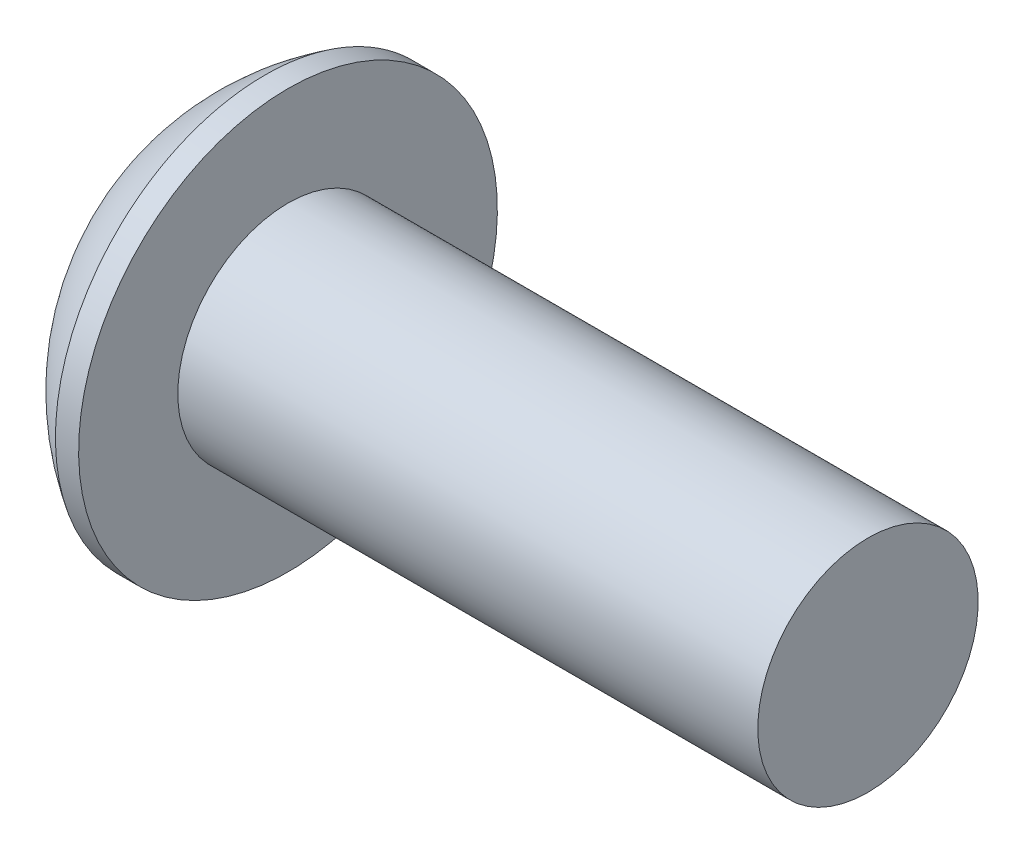
ISO-10303-21;
HEADER;
FILE_DESCRIPTION(('STEP AP214'),'2;1');
FILE_NAME('part.step','',(''),(''),'','','');
FILE_SCHEMA(('AUTOMOTIVE_DESIGN { 1 0 10303 214 1 1 1 1 }'));
ENDSEC;
DATA;
#1=APPLICATION_CONTEXT('core data for automotive mechanical design processes');
#2=APPLICATION_PROTOCOL_DEFINITION('international standard','automotive_design',2000,#1);
#3=PRODUCT_CONTEXT('',#1,'mechanical');
#4=PRODUCT('Part','Part','',(#3));
#5=PRODUCT_RELATED_PRODUCT_CATEGORY('part','',(#4));
#6=PRODUCT_DEFINITION_FORMATION('','',#4);
#7=PRODUCT_DEFINITION_CONTEXT('part definition',#1,'design');
#8=PRODUCT_DEFINITION('design','',#6,#7);
#9=PRODUCT_DEFINITION_SHAPE('','',#8);
#10=(LENGTH_UNIT() NAMED_UNIT(*) SI_UNIT(.MILLI.,.METRE.));
#11=(NAMED_UNIT(*) PLANE_ANGLE_UNIT() SI_UNIT($,.RADIAN.));
#12=(NAMED_UNIT(*) SI_UNIT($,.STERADIAN.) SOLID_ANGLE_UNIT());
#13=UNCERTAINTY_MEASURE_WITH_UNIT(LENGTH_MEASURE(1.E-05),#10,'distance_accuracy_value','');
#14=(GEOMETRIC_REPRESENTATION_CONTEXT(3) GLOBAL_UNCERTAINTY_ASSIGNED_CONTEXT((#13)) GLOBAL_UNIT_ASSIGNED_CONTEXT((#10,
#11,#12)) REPRESENTATION_CONTEXT('',''));
#15=CARTESIAN_POINT('',(0.,0.,0.));
#16=DIRECTION('',(0.,0.,1.));
#17=DIRECTION('',(1.,0.,0.));
#18=AXIS2_PLACEMENT_3D('',#15,#16,#17);
#19=CARTESIAN_POINT('',(-0.533400000000002,0.,0.));
#20=DIRECTION('',(-1.,0.,0.));
#21=DIRECTION('',(0.,0.,1.));
#22=AXIS2_PLACEMENT_3D('',#19,#20,#21);
#23=PLANE('',#22);
#24=DIRECTION('',(0.,0.5,0.866025403784439));
#25=VECTOR('',#24,1.);
#26=CARTESIAN_POINT('',(-0.533400000000002,1.83308710467706,0.));
#27=LINE('',#26,#25);
#28=CARTESIAN_POINT('',(-0.533400000000002,1.83308710467706,0.));
#29=VERTEX_POINT('',#28);
#30=CARTESIAN_POINT('',(-0.533400000000002,0.916543552338531,-1.5875));
#31=VERTEX_POINT('',#30);
#32=EDGE_CURVE('E116',#29,#31,#27,.F.);
#33=ORIENTED_EDGE('',*,*,#32,.T.);
#34=DIRECTION('',(0.,1.,0.));
#35=VECTOR('',#34,1.);
#36=CARTESIAN_POINT('',(-0.533400000000002,0.916543552338531,-1.5875));
#37=LINE('',#36,#35);
#38=CARTESIAN_POINT('',(-0.533400000000002,-0.916543552338531,-1.5875));
#39=VERTEX_POINT('',#38);
#40=EDGE_CURVE('E83',#31,#39,#37,.F.);
#41=ORIENTED_EDGE('',*,*,#40,.T.);
#42=DIRECTION('',(0.,0.5,-0.866025403784439));
#43=VECTOR('',#42,1.);
#44=CARTESIAN_POINT('',(-0.533400000000002,-0.916543552338531,-1.5875));
#45=LINE('',#44,#43);
#46=CARTESIAN_POINT('',(-0.533400000000002,-1.83308710467706,0.));
#47=VERTEX_POINT('',#46);
#48=EDGE_CURVE('E85',#39,#47,#45,.F.);
#49=ORIENTED_EDGE('',*,*,#48,.T.);
#50=DIRECTION('',(0.,-0.5,-0.866025403784439));
#51=VECTOR('',#50,1.);
#52=CARTESIAN_POINT('',(-0.533400000000002,-1.83308710467706,0.));
#53=LINE('',#52,#51);
#54=CARTESIAN_POINT('',(-0.533400000000002,-0.916543552338533,1.5875));
#55=VERTEX_POINT('',#54);
#56=EDGE_CURVE('E86',#47,#55,#53,.F.);
#57=ORIENTED_EDGE('',*,*,#56,.T.);
#58=DIRECTION('',(0.,-1.,0.));
#59=VECTOR('',#58,1.);
#60=CARTESIAN_POINT('',(-0.533400000000002,-0.916543552338532,1.5875));
#61=LINE('',#60,#59);
#62=CARTESIAN_POINT('',(-0.533400000000002,0.916543552338531,1.5875));
#63=VERTEX_POINT('',#62);
#64=EDGE_CURVE('E72',#55,#63,#61,.F.);
#65=ORIENTED_EDGE('',*,*,#64,.T.);
#66=DIRECTION('',(0.,-0.5,0.866025403784439));
#67=VECTOR('',#66,1.);
#68=CARTESIAN_POINT('',(-0.533400000000002,0.916543552338531,1.5875));
#69=LINE('',#68,#67);
#70=EDGE_CURVE('E111',#63,#29,#69,.F.);
#71=ORIENTED_EDGE('',*,*,#70,.T.);
#72=EDGE_LOOP('',(#33,#41,#49,#57,#65,#71));
#73=FACE_BOUND('',#72,.T.);
#74=ADVANCED_FACE('F18',(#73),#23,.T.);
#75=CARTESIAN_POINT('',(-0.533400000000002,-1.83308710467706,0.));
#76=DIRECTION('',(0.,-0.866025403784439,0.5));
#77=DIRECTION('',(0.,-0.5,-0.866025403784439));
#78=AXIS2_PLACEMENT_3D('',#75,#76,#77);
#79=PLANE('',#78);
#80=CARTESIAN_POINT('',(-2.56539999994394,-1.8330871046745,-2.00804498786736E-11));
#81=CARTESIAN_POINT('',(-2.53392818229741,-1.80158505518366,0.0545631502562923));
#82=CARTESIAN_POINT('',(-2.5043050627177,-1.76955629074211,0.110038597579172));
#83=CARTESIAN_POINT('',(-2.45006639539122,-1.70424635317817,0.223158727683824));
#84=CARTESIAN_POINT('',(-2.42548101615987,-1.6709589724711,0.280814162317604));
#85=CARTESIAN_POINT('',(-2.38336609605347,-1.60383660211837,0.397073518091736));
#86=CARTESIAN_POINT('',(-2.36573072948629,-1.57001869730198,0.455647847439699));
#87=CARTESIAN_POINT('',(-2.33856008862263,-1.50163859306838,0.574085662199493));
#88=CARTESIAN_POINT('',(-2.32900454007239,-1.46707848106388,0.633945532106421));
#89=CARTESIAN_POINT('',(-2.32038274183869,-1.40751253669323,0.737116774157155));
#90=CARTESIAN_POINT('',(-2.31910682172836,-1.38258360390154,0.780294952330845));
#91=CARTESIAN_POINT('',(-2.32125913780735,-1.33276652395073,0.866580665890379));
#92=CARTESIAN_POINT('',(-2.32468902284537,-1.30787839414808,0.90968817121394));
#93=CARTESIAN_POINT('',(-2.33605631415915,-1.25834345643267,0.995485200086784));
#94=CARTESIAN_POINT('',(-2.34399762019329,-1.23369687609494,1.03817432946455));
#95=CARTESIAN_POINT('',(-2.36395627681902,-1.18481740842653,1.12283605091316));
#96=CARTESIAN_POINT('',(-2.37597537628367,-1.16058470328902,1.16480832741616));
#97=CARTESIAN_POINT('',(-2.41164383187845,-1.09853862948576,1.27227527965358));
#98=CARTESIAN_POINT('',(-2.43797770752625,-1.06110942924036,1.33710455616529));
#99=CARTESIAN_POINT('',(-2.48243061452926,-1.00607390269188,1.43242888436855));
#100=CARTESIAN_POINT('',(-2.49804835924321,-0.987937988038022,1.46384120999077));
#101=CARTESIAN_POINT('',(-2.53070945051393,-0.951999508520197,1.52608848246242));
#102=CARTESIAN_POINT('',(-2.54775211871235,-0.934196789917587,1.55692369559499));
#103=CARTESIAN_POINT('',(-2.56539999993807,-0.916543552329633,1.58750000001541));
#104=B_SPLINE_CURVE_WITH_KNOTS('',3,(#80,#81,#82,#83,#84,#85,#86,#87,#88,#89,#90,#91,#92,#93,
#94,#95,#96,#97,#98,#99,#100,#101,#102,#103),.UNSPECIFIED.,.F.,.F.,(4,2,2,2,2,2,2,2,2,2,2,4),
(0.,0.211427927732169,0.424087197148228,0.633370156422424,0.842126401515785,0.991537201098734,
1.14100036552056,1.29059292577265,1.44024972414947,1.67781721417335,1.79627069411587,
1.91466809995991),.UNSPECIFIED.);
#105=CARTESIAN_POINT('',(-2.56539999993857,-1.83308710468646,0.));
#106=VERTEX_POINT('',#105);
#107=CARTESIAN_POINT('',(-2.56539999993106,-0.916543552342318,1.5875));
#108=VERTEX_POINT('',#107);
#109=EDGE_CURVE('E21',#106,#108,#104,.T.);
#110=ORIENTED_EDGE('',*,*,#109,.T.);
#111=DIRECTION('',(1.,0.,0.));
#112=VECTOR('',#111,1.);
#113=CARTESIAN_POINT('',(-0.533400000000002,-0.916543552338533,1.5875));
#114=LINE('',#113,#112);
#115=EDGE_CURVE('E91',#108,#55,#114,.T.);
#116=ORIENTED_EDGE('',*,*,#115,.T.);
#117=ORIENTED_EDGE('',*,*,#56,.F.);
#118=DIRECTION('',(1.,0.,0.));
#119=VECTOR('',#118,1.);
#120=CARTESIAN_POINT('',(-0.533400000000002,-1.83308710467706,0.));
#121=LINE('',#120,#119);
#122=EDGE_CURVE('E59',#47,#106,#121,.F.);
#123=ORIENTED_EDGE('',*,*,#122,.T.);
#124=EDGE_LOOP('',(#110,#116,#117,#123));
#125=FACE_BOUND('',#124,.T.);
#126=ADVANCED_FACE('F90',(#125),#79,.F.);
#127=CARTESIAN_POINT('',(-0.533400000000002,-0.916543552338531,-1.5875));
#128=DIRECTION('',(0.,-0.866025403784439,-0.5));
#129=DIRECTION('',(0.,0.5,-0.866025403784439));
#130=AXIS2_PLACEMENT_3D('',#127,#128,#129);
#131=PLANE('',#130);
#132=CARTESIAN_POINT('',(-2.56539999994527,-0.916543552319403,-1.58750000001409));
#133=CARTESIAN_POINT('',(-2.53392818229919,-0.948045601822691,-1.53293684974403));
#134=CARTESIAN_POINT('',(-2.50430506271949,-0.980074366269487,-1.47746140242354));
#135=CARTESIAN_POINT('',(-2.45006639539264,-1.04538430383757,-1.36434127232016));
#136=CARTESIAN_POINT('',(-2.42548101616093,-1.07867168454351,-1.30668583768523));
#137=CARTESIAN_POINT('',(-2.38336609605398,-1.14579405489574,-1.19042648190974));
#138=CARTESIAN_POINT('',(-2.36573072948662,-1.17961195971273,-1.13185215256154));
#139=CARTESIAN_POINT('',(-2.3385600886227,-1.2479920639471,-1.013414337801));
#140=CARTESIAN_POINT('',(-2.32900454007237,-1.28255217595175,-0.953554467893575));
#141=CARTESIAN_POINT('',(-2.32038274183866,-1.34211812032265,-0.850383225842316));
#142=CARTESIAN_POINT('',(-2.31910682172835,-1.36704705311438,-0.807205047668587));
#143=CARTESIAN_POINT('',(-2.32125913780739,-1.41686413306525,-0.720919334108961));
#144=CARTESIAN_POINT('',(-2.32468902284544,-1.44175226286793,-0.67781182878535));
#145=CARTESIAN_POINT('',(-2.33605631415929,-1.49128720058339,-0.592014799912417));
#146=CARTESIAN_POINT('',(-2.34399762019345,-1.51593378092113,-0.54932567053461));
#147=CARTESIAN_POINT('',(-2.36395627681926,-1.56481324858959,-0.464663949085931));
#148=CARTESIAN_POINT('',(-2.37597537628395,-1.58904595372712,-0.422691672582891));
#149=CARTESIAN_POINT('',(-2.41164383187876,-1.65109202753029,-0.315224720345625));
#150=CARTESIAN_POINT('',(-2.43797770752652,-1.6885212277756,-0.250395443834082));
#151=CARTESIAN_POINT('',(-2.48243061452944,-1.74355675432393,-0.15507111563107));
#152=CARTESIAN_POINT('',(-2.49804835924337,-1.76169266897775,-0.123658790008927));
#153=CARTESIAN_POINT('',(-2.53070945051401,-1.79763114849548,-0.0614115175374324));
#154=CARTESIAN_POINT('',(-2.5477521187124,-1.81543386709805,-0.0305763044049344));
#155=CARTESIAN_POINT('',(-2.56539999993807,-1.83308710468596,1.54136844652939E-11));
#156=B_SPLINE_CURVE_WITH_KNOTS('',3,(#132,#133,#134,#135,#136,#137,#138,#139,#140,#141,#142,
#143,#144,#145,#146,#147,#148,#149,#150,#151,#152,#153,#154,#155),.UNSPECIFIED.,.F.,.F.,(4,2,2,
2,2,2,2,2,2,2,2,4),(0.,0.211427927733669,0.424087197151313,0.633370156427101,0.842126401522016,
0.99153720110513,1.14100036552713,1.29059292577937,1.44024972415633,1.67781721417961,
1.79627069412184,1.9146680999656),.UNSPECIFIED.);
#157=CARTESIAN_POINT('',(-2.56539999995198,-0.916543552351339,-1.58750000002218));
#158=VERTEX_POINT('',#157);
#159=EDGE_CURVE('E95',#158,#106,#156,.T.);
#160=ORIENTED_EDGE('',*,*,#159,.T.);
#161=ORIENTED_EDGE('',*,*,#122,.F.);
#162=ORIENTED_EDGE('',*,*,#48,.F.);
#163=DIRECTION('',(-1.,0.,0.));
#164=VECTOR('',#163,1.);
#165=CARTESIAN_POINT('',(-0.533400000000002,-0.916543552338531,-1.5875));
#166=LINE('',#165,#164);
#167=EDGE_CURVE('E97',#39,#158,#166,.T.);
#168=ORIENTED_EDGE('',*,*,#167,.T.);
#169=EDGE_LOOP('',(#160,#161,#162,#168));
#170=FACE_BOUND('',#169,.T.);
#171=ADVANCED_FACE('F93',(#170),#131,.F.);
#172=CARTESIAN_POINT('',(-0.533400000000002,0.916543552338531,-1.5875));
#173=DIRECTION('',(0.,0.,-1.));
#174=DIRECTION('',(-1.,0.,0.));
#175=AXIS2_PLACEMENT_3D('',#172,#173,#174);
#176=PLANE('',#175);
#177=CARTESIAN_POINT('',(-2.56539999994527,0.916543552360294,-1.58749999999048));
#178=CARTESIAN_POINT('',(-2.53392818229821,0.853539453376781,-1.58749999999657));
#179=CARTESIAN_POINT('',(-2.50430506271702,0.789481924500113,-1.58749999999908));
#180=CARTESIAN_POINT('',(-2.45006639538581,0.658862049392287,-1.58750000000093));
#181=CARTESIAN_POINT('',(-2.42548101615122,0.59228728799181,-1.58750000000025));
#182=CARTESIAN_POINT('',(-2.38336609603683,0.458042547310979,-1.58749999999976));
#183=CARTESIAN_POINT('',(-2.36573072946494,0.390406737689213,-1.58749999999994));
#184=CARTESIAN_POINT('',(-2.3385600885904,0.253646529243895,-1.58750000000006));
#185=CARTESIAN_POINT('',(-2.32900454003397,0.184526305245804,-1.58750000000001));
#186=CARTESIAN_POINT('',(-2.32038274178942,0.0653944165301613,-1.58749999999999));
#187=CARTESIAN_POINT('',(-2.31910682167392,0.0155365509618711,-1.5875));
#188=CARTESIAN_POINT('',(-2.3212591377409,-0.0840976089101244,-1.5875));
#189=CARTESIAN_POINT('',(-2.32468902277208,-0.133873868500894,-1.5875));
#190=CARTESIAN_POINT('',(-2.33605631407098,-0.2329437439033,-1.5875));
#191=CARTESIAN_POINT('',(-2.34399762009707,-0.282236904564879,-1.5875));
#192=CARTESIAN_POINT('',(-2.36395627670599,-0.379995839874564,-1.5875));
#193=CARTESIAN_POINT('',(-2.37597537616188,-0.428461250136325,-1.5875));
#194=CARTESIAN_POINT('',(-2.41164383175616,-0.552553397787632,-1.5875));
#195=CARTESIAN_POINT('',(-2.43797770742117,-0.627411798334259,-1.5875));
#196=CARTESIAN_POINT('',(-2.48243061445881,-0.737482851511091,-1.5875));
#197=CARTESIAN_POINT('',(-2.49804835918582,-0.773754680844889,-1.5875));
#198=CARTESIAN_POINT('',(-2.53070945048496,-0.845631639931401,-1.5875));
#199=CARTESIAN_POINT('',(-2.54775211869874,-0.881237077161412,-1.5875));
#200=CARTESIAN_POINT('',(-2.56539999994071,-0.916543552361606,-1.5875));
#201=B_SPLINE_CURVE_WITH_KNOTS('',3,(#177,#178,#179,#180,#181,#182,#183,#184,#185,#186,#187,
#188,#189,#190,#191,#192,#193,#194,#195,#196,#197,#198,#199,#200),.UNSPECIFIED.,.F.,.F.,(4,2,2,
2,2,2,2,2,2,2,2,4),(0.,0.211427927701375,0.424087197086717,0.633370156331471,0.842126401395377,
0.991537200933545,1.14100036531054,1.29059292551773,1.44024972384963,1.677817214047,
1.79627069407681,1.91466810000777),.UNSPECIFIED.);
#202=CARTESIAN_POINT('',(-2.56539999995198,0.916543552337129,-1.58749999999757));
#203=VERTEX_POINT('',#202);
#204=EDGE_CURVE('E199',#203,#158,#201,.T.);
#205=ORIENTED_EDGE('',*,*,#204,.T.);
#206=ORIENTED_EDGE('',*,*,#167,.F.);
#207=ORIENTED_EDGE('',*,*,#40,.F.);
#208=DIRECTION('',(1.,0.,0.));
#209=VECTOR('',#208,1.);
#210=CARTESIAN_POINT('',(-0.533400000000002,0.916543552338531,-1.5875));
#211=LINE('',#210,#209);
#212=EDGE_CURVE('E113',#31,#203,#211,.F.);
#213=ORIENTED_EDGE('',*,*,#212,.T.);
#214=EDGE_LOOP('',(#205,#206,#207,#213));
#215=FACE_BOUND('',#214,.T.);
#216=ADVANCED_FACE('F189',(#215),#176,.F.);
#217=CARTESIAN_POINT('',(-0.533400000000002,1.83308710467706,0.));
#218=DIRECTION('',(0.,0.866025403784439,-0.5));
#219=DIRECTION('',(0.,0.5,0.866025403784439));
#220=AXIS2_PLACEMENT_3D('',#217,#218,#219);
#221=PLANE('',#220);
#222=CARTESIAN_POINT('',(-2.56539999994394,1.8330871046745,2.00800374309997E-11));
#223=CARTESIAN_POINT('',(-2.5339281822974,1.80158505518366,-0.0545631502562965));
#224=CARTESIAN_POINT('',(-2.5043050627177,1.76955629074211,-0.11003859757918));
#225=CARTESIAN_POINT('',(-2.45006639539121,1.70424635317816,-0.22315872768384));
#226=CARTESIAN_POINT('',(-2.42548101615987,1.67095897247109,-0.280814162317626));
#227=CARTESIAN_POINT('',(-2.38336609605347,1.60383660211835,-0.397073518091758));
#228=CARTESIAN_POINT('',(-2.36573072948628,1.57001869730197,-0.455647847439717));
#229=CARTESIAN_POINT('',(-2.33856008862263,1.50163859306837,-0.574085662199503));
#230=CARTESIAN_POINT('',(-2.32900454007239,1.46707848106388,-0.633945532106426));
#231=CARTESIAN_POINT('',(-2.32038274183869,1.40751253669322,-0.737116774157154));
#232=CARTESIAN_POINT('',(-2.31910682172836,1.38258360390154,-0.780294952330843));
#233=CARTESIAN_POINT('',(-2.32125913780735,1.33276652395073,-0.866580665890374));
#234=CARTESIAN_POINT('',(-2.32468902284537,1.30787839414808,-0.909688171213933));
#235=CARTESIAN_POINT('',(-2.33605631415915,1.25834345643267,-0.995485200086777));
#236=CARTESIAN_POINT('',(-2.34399762019328,1.23369687609495,-1.03817432946455));
#237=CARTESIAN_POINT('',(-2.36395627681902,1.18481740842653,-1.12283605091316));
#238=CARTESIAN_POINT('',(-2.37597537628367,1.16058470328902,-1.16480832741616));
#239=CARTESIAN_POINT('',(-2.41164383187872,1.09853862948529,-1.2722752796544));
#240=CARTESIAN_POINT('',(-2.43797770752691,1.06110942923942,-1.33710455616691));
#241=CARTESIAN_POINT('',(-2.48243061453059,1.00607390269029,-1.43242888437131));
#242=CARTESIAN_POINT('',(-2.49804835924479,0.987937988036214,-1.4638412099939));
#243=CARTESIAN_POINT('',(-2.53070945051602,0.951999508517968,-1.52608848246628));
#244=CARTESIAN_POINT('',(-2.54775211871471,0.934196789915152,-1.55692369559921));
#245=CARTESIAN_POINT('',(-2.56539999994071,0.916543552326994,-1.58750000001998));
#246=B_SPLINE_CURVE_WITH_KNOTS('',3,(#222,#223,#224,#225,#226,#227,#228,#229,#230,#231,#232,
#233,#234,#235,#236,#237,#238,#239,#240,#241,#242,#243,#244,#245),.UNSPECIFIED.,.F.,.F.,(4,2,2,
2,2,2,2,2,2,2,2,4),(0.,0.211427927732185,0.424087197148259,0.63337015642244,0.842126401515786,
0.99153720109873,1.14100036552055,1.29059292577265,1.44024972414947,1.67781721417631,
1.7962706941203,1.9146680999658),.UNSPECIFIED.);
#247=CARTESIAN_POINT('',(-2.56539999993857,1.83308710468646,0.));
#248=VERTEX_POINT('',#247);
#249=EDGE_CURVE('E193',#248,#203,#246,.T.);
#250=ORIENTED_EDGE('',*,*,#249,.T.);
#251=ORIENTED_EDGE('',*,*,#212,.F.);
#252=ORIENTED_EDGE('',*,*,#32,.F.);
#253=DIRECTION('',(1.,0.,0.));
#254=VECTOR('',#253,1.);
#255=CARTESIAN_POINT('',(-0.533400000000002,1.83308710467706,0.));
#256=LINE('',#255,#254);
#257=EDGE_CURVE('E108',#29,#248,#256,.F.);
#258=ORIENTED_EDGE('',*,*,#257,.T.);
#259=EDGE_LOOP('',(#250,#251,#252,#258));
#260=FACE_BOUND('',#259,.T.);
#261=ADVANCED_FACE('F185',(#260),#221,.F.);
#262=CARTESIAN_POINT('',(-0.533400000000002,0.916543552338531,1.5875));
#263=DIRECTION('',(0.,0.866025403784439,0.5));
#264=DIRECTION('',(0.,-0.5,0.866025403784439));
#265=AXIS2_PLACEMENT_3D('',#262,#263,#264);
#266=PLANE('',#265);
#267=CARTESIAN_POINT('',(-2.56539999994394,0.91654355231986,1.58750000000782));
#268=CARTESIAN_POINT('',(-2.53392818229741,0.948045601824288,1.5329368497393));
#269=CARTESIAN_POINT('',(-2.5043050627177,0.980074366271431,1.47746140241964));
#270=CARTESIAN_POINT('',(-2.45006639539122,1.04538430383949,1.36434127231737));
#271=CARTESIAN_POINT('',(-2.42548101615987,1.07867168454504,1.30668583768271));
#272=CARTESIAN_POINT('',(-2.38336609605347,1.14579405489669,1.19042648190795));
#273=CARTESIAN_POINT('',(-2.36573072948629,1.17961195971347,1.13185215256022));
#274=CARTESIAN_POINT('',(-2.33856008862263,1.24799206394736,1.01341433780059));
#275=CARTESIAN_POINT('',(-2.32900454007239,1.28255217595174,0.953554467893597));
#276=CARTESIAN_POINT('',(-2.32038274183869,1.34211812032234,0.850383225842832));
#277=CARTESIAN_POINT('',(-2.31910682172836,1.36704705311405,0.807205047669152));
#278=CARTESIAN_POINT('',(-2.32125913780735,1.41686413306487,0.720919334109624));
#279=CARTESIAN_POINT('',(-2.32468902284537,1.44175226286752,0.677811828786061));
#280=CARTESIAN_POINT('',(-2.33605631415915,1.49128720058292,0.592014799913215));
#281=CARTESIAN_POINT('',(-2.34399762019328,1.51593378092065,0.549325670535446));
#282=CARTESIAN_POINT('',(-2.36395627681902,1.56481324858906,0.464663949086841));
#283=CARTESIAN_POINT('',(-2.37597537628367,1.58904595372657,0.422691672583837));
#284=CARTESIAN_POINT('',(-2.41164383187845,1.65109202752983,0.315224720346425));
#285=CARTESIAN_POINT('',(-2.43797770752625,1.68852122777524,0.250395443834706));
#286=CARTESIAN_POINT('',(-2.48243061452926,1.74355675432371,0.155071115631445));
#287=CARTESIAN_POINT('',(-2.49804835924321,1.76169266897757,0.123658790009225));
#288=CARTESIAN_POINT('',(-2.53070945051393,1.7976311484954,0.0614115175375789));
#289=CARTESIAN_POINT('',(-2.54775211871235,1.81543386709801,0.0305763044050067));
#290=CARTESIAN_POINT('',(-2.56539999993807,1.83308710468596,-1.54142580803093E-11));
#291=B_SPLINE_CURVE_WITH_KNOTS('',3,(#267,#268,#269,#270,#271,#272,#273,#274,#275,#276,#277,
#278,#279,#280,#281,#282,#283,#284,#285,#286,#287,#288,#289,#290),.UNSPECIFIED.,.F.,.F.,(4,2,2,
2,2,2,2,2,2,2,2,4),(0.,0.211427927732169,0.424087197148227,0.633370156422423,0.842126401515785,
0.991537201098733,1.14100036552056,1.29059292577265,1.44024972414946,1.67781721417335,
1.79627069411587,1.91466809995991),.UNSPECIFIED.);
#292=CARTESIAN_POINT('',(-2.56539999993857,0.91654355234323,1.58750000000814));
#293=VERTEX_POINT('',#292);
#294=EDGE_CURVE('E167',#293,#248,#291,.T.);
#295=ORIENTED_EDGE('',*,*,#294,.T.);
#296=ORIENTED_EDGE('',*,*,#257,.F.);
#297=ORIENTED_EDGE('',*,*,#70,.F.);
#298=DIRECTION('',(1.,0.,0.));
#299=VECTOR('',#298,1.);
#300=CARTESIAN_POINT('',(-0.533400000000002,0.916543552338531,1.5875));
#301=LINE('',#300,#299);
#302=EDGE_CURVE('E40',#63,#293,#301,.F.);
#303=ORIENTED_EDGE('',*,*,#302,.T.);
#304=EDGE_LOOP('',(#295,#296,#297,#303));
#305=FACE_BOUND('',#304,.T.);
#306=ADVANCED_FACE('F178',(#305),#266,.F.);
#307=CARTESIAN_POINT('',(-0.533400000000002,-0.916543552338532,1.5875));
#308=DIRECTION('',(0.,0.,1.));
#309=DIRECTION('',(0.,-1.,0.));
#310=AXIS2_PLACEMENT_3D('',#307,#308,#309);
#311=PLANE('',#310);
#312=CARTESIAN_POINT('',(-2.56539999994394,-0.916543552354642,1.58749999998774));
#313=CARTESIAN_POINT('',(-2.53392818229741,-0.853539453359365,1.58749999999559));
#314=CARTESIAN_POINT('',(-2.50430506271771,-0.789481924470656,1.58749999999882));
#315=CARTESIAN_POINT('',(-2.45006639539122,-0.658862049338629,1.58750000000119));
#316=CARTESIAN_POINT('',(-2.42548101615988,-0.592287287925995,1.58750000000032));
#317=CARTESIAN_POINT('',(-2.38336609605349,-0.458042547221593,1.58749999999969));
#318=CARTESIAN_POINT('',(-2.36573072948631,-0.390406737588416,1.58749999999992));
#319=CARTESIAN_POINT('',(-2.33856008862266,-0.253646529120892,1.58750000000008));
#320=CARTESIAN_POINT('',(-2.32900454007243,-0.184526305112002,1.58750000000002));
#321=CARTESIAN_POINT('',(-2.32038274183874,-0.065394416370719,1.58749999999999));
#322=CARTESIAN_POINT('',(-2.31910682172841,-0.0155365507873145,1.5875));
#323=CARTESIAN_POINT('',(-2.32125913780742,0.0840976091143436,1.5875));
#324=CARTESIAN_POINT('',(-2.32468902284545,0.133873868719661,1.5875));
#325=CARTESIAN_POINT('',(-2.33605631415924,0.232943744150505,1.5875));
#326=CARTESIAN_POINT('',(-2.34399762019338,0.282236904825971,1.5875));
#327=CARTESIAN_POINT('',(-2.36395627681913,0.379995840162817,1.5875));
#328=CARTESIAN_POINT('',(-2.37597537628379,0.428461250437852,1.5875));
#329=CARTESIAN_POINT('',(-2.41164383187857,0.552553398044325,1.5875));
#330=CARTESIAN_POINT('',(-2.43797770752636,0.627411798535089,1.5875));
#331=CARTESIAN_POINT('',(-2.48243061452933,0.737482851631955,1.5875));
#332=CARTESIAN_POINT('',(-2.49804835924327,0.773754680939651,1.5875));
#333=CARTESIAN_POINT('',(-2.53070945051396,0.84563163997525,1.5875));
#334=CARTESIAN_POINT('',(-2.54775211871237,0.881237077180446,1.5875));
#335=CARTESIAN_POINT('',(-2.56539999993807,0.91654355235633,1.5875));
#336=B_SPLINE_CURVE_WITH_KNOTS('',3,(#312,#313,#314,#315,#316,#317,#318,#319,#320,#321,#322,
#323,#324,#325,#326,#327,#328,#329,#330,#331,#332,#333,#334,#335),.UNSPECIFIED.,.F.,.F.,(4,2,2,
2,2,2,2,2,2,2,2,4),(0.,0.211427927732202,0.424087197148294,0.633370156422521,0.842126401515914,
0.991537201098908,1.14100036552078,1.29059292577292,1.44024972414978,1.67781721417349,
1.79627069411592,1.91466809995988),.UNSPECIFIED.);
#337=EDGE_CURVE('E159',#108,#293,#336,.T.);
#338=ORIENTED_EDGE('',*,*,#337,.T.);
#339=ORIENTED_EDGE('',*,*,#302,.F.);
#340=ORIENTED_EDGE('',*,*,#64,.F.);
#341=ORIENTED_EDGE('',*,*,#115,.F.);
#342=EDGE_LOOP('',(#338,#339,#340,#341));
#343=FACE_BOUND('',#342,.T.);
#344=ADVANCED_FACE('F174',(#343),#311,.F.);
#345=CARTESIAN_POINT('',(-2.56540000003724,0.,0.));
#346=DIRECTION('',(-1.,0.,0.));
#347=DIRECTION('',(0.,-1.,0.));
#348=AXIS2_PLACEMENT_3D('',#345,#346,#347);
#349=CONICAL_SURFACE('',#348,1.83308710478514,0.78539816351237);
#350=ORIENTED_EDGE('',*,*,#109,.F.);
#351=CARTESIAN_POINT('',(-2.56539999992356,0.,0.));
#352=DIRECTION('',(-1.,0.,0.));
#353=DIRECTION('',(0.,-1.,0.));
#354=AXIS2_PLACEMENT_3D('',#351,#352,#353);
#355=CIRCLE('',#354,1.83308710467145);
#356=EDGE_CURVE('E166',#108,#106,#355,.F.);
#357=ORIENTED_EDGE('',*,*,#356,.F.);
#358=EDGE_LOOP('',(#350,#357));
#359=FACE_BOUND('',#358,.T.);
#360=ADVANCED_FACE('F177',(#359),#349,.F.);
#361=CARTESIAN_POINT('',(-2.56540000003724,0.,0.));
#362=DIRECTION('',(-1.,0.,0.));
#363=DIRECTION('',(0.,-1.,0.));
#364=AXIS2_PLACEMENT_3D('',#361,#362,#363);
#365=CONICAL_SURFACE('',#364,1.83308710478514,0.78539816351237);
#366=ORIENTED_EDGE('',*,*,#159,.F.);
#367=CARTESIAN_POINT('',(-2.56539999992356,0.,0.));
#368=DIRECTION('',(-1.,0.,0.));
#369=DIRECTION('',(0.,-1.,0.));
#370=AXIS2_PLACEMENT_3D('',#367,#368,#369);
#371=CIRCLE('',#370,1.83308710467145);
#372=EDGE_CURVE('E273',#106,#158,#371,.F.);
#373=ORIENTED_EDGE('',*,*,#372,.F.);
#374=EDGE_LOOP('',(#366,#373));
#375=FACE_BOUND('',#374,.T.);
#376=ADVANCED_FACE('F211',(#375),#365,.F.);
#377=CARTESIAN_POINT('',(-2.56540000003724,0.,0.));
#378=DIRECTION('',(-1.,0.,0.));
#379=DIRECTION('',(0.,-1.,0.));
#380=AXIS2_PLACEMENT_3D('',#377,#378,#379);
#381=CONICAL_SURFACE('',#380,1.83308710478514,0.785398163397448);
#382=ORIENTED_EDGE('',*,*,#204,.F.);
#383=CARTESIAN_POINT('',(-2.5653999999804,0.,0.));
#384=DIRECTION('',(-1.,0.,0.));
#385=DIRECTION('',(0.,-1.,0.));
#386=AXIS2_PLACEMENT_3D('',#383,#384,#385);
#387=CIRCLE('',#386,1.83308710472829);
#388=EDGE_CURVE('E270',#158,#203,#387,.F.);
#389=ORIENTED_EDGE('',*,*,#388,.F.);
#390=EDGE_LOOP('',(#382,#389));
#391=FACE_BOUND('',#390,.T.);
#392=ADVANCED_FACE('F207',(#391),#381,.F.);
#393=CARTESIAN_POINT('',(-2.56540000003724,0.,0.));
#394=DIRECTION('',(-1.,0.,0.));
#395=DIRECTION('',(0.,-1.,0.));
#396=AXIS2_PLACEMENT_3D('',#393,#394,#395);
#397=CONICAL_SURFACE('',#396,1.83308710478514,0.78539816351237);
#398=ORIENTED_EDGE('',*,*,#249,.F.);
#399=CARTESIAN_POINT('',(-2.56539999992356,0.,0.));
#400=DIRECTION('',(-1.,0.,0.));
#401=DIRECTION('',(0.,-1.,0.));
#402=AXIS2_PLACEMENT_3D('',#399,#400,#401);
#403=CIRCLE('',#402,1.83308710467145);
#404=EDGE_CURVE('E267',#203,#248,#403,.F.);
#405=ORIENTED_EDGE('',*,*,#404,.F.);
#406=EDGE_LOOP('',(#398,#405));
#407=FACE_BOUND('',#406,.T.);
#408=ADVANCED_FACE('F204',(#407),#397,.F.);
#409=CARTESIAN_POINT('',(-2.56540000003724,0.,0.));
#410=DIRECTION('',(-1.,0.,0.));
#411=DIRECTION('',(0.,-1.,0.));
#412=AXIS2_PLACEMENT_3D('',#409,#410,#411);
#413=CONICAL_SURFACE('',#412,1.83308710478514,0.78539816351237);
#414=ORIENTED_EDGE('',*,*,#294,.F.);
#415=CARTESIAN_POINT('',(-2.56539999992356,0.,0.));
#416=DIRECTION('',(-1.,0.,0.));
#417=DIRECTION('',(0.,-1.,0.));
#418=AXIS2_PLACEMENT_3D('',#415,#416,#417);
#419=CIRCLE('',#418,1.83308710467145);
#420=EDGE_CURVE('E262',#248,#293,#419,.F.);
#421=ORIENTED_EDGE('',*,*,#420,.F.);
#422=EDGE_LOOP('',(#414,#421));
#423=FACE_BOUND('',#422,.T.);
#424=ADVANCED_FACE('F154',(#423),#413,.F.);
#425=CARTESIAN_POINT('',(-2.56540000003724,0.,0.));
#426=DIRECTION('',(-1.,0.,0.));
#427=DIRECTION('',(0.,-1.,0.));
#428=AXIS2_PLACEMENT_3D('',#425,#426,#427);
#429=CONICAL_SURFACE('',#428,1.83308710478514,0.785398163512485);
#430=ORIENTED_EDGE('',*,*,#337,.F.);
#431=CARTESIAN_POINT('',(-2.56539999992356,0.,0.));
#432=DIRECTION('',(-1.,0.,0.));
#433=DIRECTION('',(0.,-1.,0.));
#434=AXIS2_PLACEMENT_3D('',#431,#432,#433);
#435=CIRCLE('',#434,1.83308710467145);
#436=EDGE_CURVE('E139',#293,#108,#435,.F.);
#437=ORIENTED_EDGE('',*,*,#436,.F.);
#438=EDGE_LOOP('',(#430,#437));
#439=FACE_BOUND('',#438,.T.);
#440=ADVANCED_FACE('F149',(#439),#429,.F.);
#441=CARTESIAN_POINT('',(-2.5654,0.,0.));
#442=DIRECTION('',(-1.,0.,0.));
#443=DIRECTION('',(0.,-1.,0.));
#444=AXIS2_PLACEMENT_3D('',#441,#442,#443);
#445=PLANE('',#444);
#446=CARTESIAN_POINT('',(-2.5654,-2.29235000000002,0.));
#447=CARTESIAN_POINT('',(-2.56540000000001,-2.29234961429958,-0.0643619991867162));
#448=CARTESIAN_POINT('',(-2.56540000000002,-2.28963695190109,-0.128735826629366));
#449=CARTESIAN_POINT('',(-2.56539999999999,-2.27880393843649,-0.257038618985287));
#450=CARTESIAN_POINT('',(-2.56539999999995,-2.27068199085128,-0.320967446929163));
#451=CARTESIAN_POINT('',(-2.56540000000006,-2.24906694794257,-0.448021254607718));
#452=CARTESIAN_POINT('',(-2.56540000000021,-2.23556532653462,-0.511144793381861));
#453=CARTESIAN_POINT('',(-2.56539999999979,-2.20328400495645,-0.636065176149322));
#454=CARTESIAN_POINT('',(-2.56539999999921,-2.18450002159115,-0.697860899533935));
#455=CARTESIAN_POINT('',(-2.56539999999869,-2.12048422735804,-0.88032980292775));
#456=CARTESIAN_POINT('',(-2.56539999999995,-2.0675359907946,-0.99839179592812));
#457=CARTESIAN_POINT('',(-2.56540000000006,-1.94254204858674,-1.22393765942148));
#458=CARTESIAN_POINT('',(-2.56539999999891,-1.87049561696644,-1.33142112758208));
#459=CARTESIAN_POINT('',(-2.56539999999932,-1.74974254194881,-1.48237719670935));
#460=CARTESIAN_POINT('',(-2.56539999999982,-1.70734573132302,-1.53101280076738));
#461=CARTESIAN_POINT('',(-2.56540000000018,-1.6186391029153,-1.62450601319185));
#462=CARTESIAN_POINT('',(-2.56540000000005,-1.57233309727313,-1.66936721890417));
#463=CARTESIAN_POINT('',(-2.56539999999995,-1.47608431707234,-1.7550488420402));
#464=CARTESIAN_POINT('',(-2.56539999999999,-1.42613990458995,-1.79586741981512));
#465=CARTESIAN_POINT('',(-2.56540000000002,-1.32299452541252,-1.87315615311523));
#466=CARTESIAN_POINT('',(-2.56540000000001,-1.26979280714188,-1.90962529930697));
#467=CARTESIAN_POINT('',(-2.56539999999999,-1.10588180153953,-2.0120772215109));
#468=CARTESIAN_POINT('',(-2.5654,-0.990764947001321,-2.07119486286667));
#469=CARTESIAN_POINT('',(-2.5654,-0.752302198839727,-2.16922858468856));
#470=CARTESIAN_POINT('',(-2.5654,-0.628956393121269,-2.2081448809145));
#471=CARTESIAN_POINT('',(-2.5654,-0.377466101733277,-2.2647275576592));
#472=CARTESIAN_POINT('',(-2.5654,-0.249321590440388,-2.28239382469379));
#473=CARTESIAN_POINT('',(-2.5654,0.0081143537161001,-2.29595665980956));
#474=CARTESIAN_POINT('',(-2.5654,0.137405786579698,-2.29185322789073));
#475=CARTESIAN_POINT('',(-2.5654,0.393449386933719,-2.2620096240906));
#476=CARTESIAN_POINT('',(-2.5654,0.520201567981077,-2.23626956775766));
#477=CARTESIAN_POINT('',(-2.5654,0.767645294384444,-2.16383549332687));
#478=CARTESIAN_POINT('',(-2.5654,0.888336774993549,-2.11714125142686));
#479=CARTESIAN_POINT('',(-2.5654,1.06210572146655,-2.03247976453654));
#480=CARTESIAN_POINT('',(-2.5654,1.11884498714066,-2.00180278323696));
#481=CARTESIAN_POINT('',(-2.5654,1.22954062855572,-1.93578011658036));
#482=CARTESIAN_POINT('',(-2.5654,1.28349764565392,-1.9004355139425));
#483=CARTESIAN_POINT('',(-2.5654,1.38821676641537,-1.82534174602348));
#484=CARTESIAN_POINT('',(-2.5654,1.43898030563028,-1.78559458231503));
#485=CARTESIAN_POINT('',(-2.5654,1.53701984534431,-1.70193996292362));
#486=CARTESIAN_POINT('',(-2.5654,1.5842924328055,-1.65802852924127));
#487=CARTESIAN_POINT('',(-2.5654,1.72023903553758,-1.52059650554139));
#488=CARTESIAN_POINT('',(-2.5654,1.80318066138239,-1.42127847626519));
#489=CARTESIAN_POINT('',(-2.5654,1.95118232345098,-1.21011519784664));
#490=CARTESIAN_POINT('',(-2.5654,2.01624303935584,-1.09827042509272));
#491=CARTESIAN_POINT('',(-2.5654,2.09907772661314,-0.923538238005839));
#492=CARTESIAN_POINT('',(-2.5654,2.12425103063558,-0.864058373981966));
#493=CARTESIAN_POINT('',(-2.5654,2.16947990046565,-0.743221562175601));
#494=CARTESIAN_POINT('',(-2.5654,2.18953960800684,-0.681866178863365));
#495=CARTESIAN_POINT('',(-2.5654,2.22438542051156,-0.557786972400356));
#496=CARTESIAN_POINT('',(-2.5654,2.23917985294818,-0.495065478128172));
#497=CARTESIAN_POINT('',(-2.5654,2.26343456384453,-0.368611258323514));
#498=CARTESIAN_POINT('',(-2.5654,2.27289641559285,-0.304878836759566));
#499=CARTESIAN_POINT('',(-2.5654,2.28388649696736,-0.200873029360621));
#500=CARTESIAN_POINT('',(-2.5654,2.28705930623293,-0.160766164180096));
#501=CARTESIAN_POINT('',(-2.5654,2.29129117827044,-0.0804410725432706));
#502=CARTESIAN_POINT('',(-2.5654,2.29235024104238,-0.0402228460869715));
#503=CARTESIAN_POINT('',(-2.56540000000001,2.29234961429956,0.0643619991867166));
#504=CARTESIAN_POINT('',(-2.56540000000002,2.28963695190107,0.128735826629366));
#505=CARTESIAN_POINT('',(-2.56539999999999,2.27880393843648,0.257038618985288));
#506=CARTESIAN_POINT('',(-2.56539999999995,2.27068199085126,0.320967446929163));
#507=CARTESIAN_POINT('',(-2.56540000000006,2.24906694794255,0.448021254607719));
#508=CARTESIAN_POINT('',(-2.56540000000021,2.2355653265346,0.511144793381862));
#509=CARTESIAN_POINT('',(-2.56539999999979,2.20328400495644,0.636065176149322));
#510=CARTESIAN_POINT('',(-2.56539999999921,2.18450002159113,0.697860899533936));
#511=CARTESIAN_POINT('',(-2.56539999999869,2.12048422735802,0.88032980292775));
#512=CARTESIAN_POINT('',(-2.56539999999995,2.06753599079459,0.998391795928119));
#513=CARTESIAN_POINT('',(-2.56540000000006,1.94254204858672,1.22393765942147));
#514=CARTESIAN_POINT('',(-2.56539999999891,1.87049561696642,1.33142112758208));
#515=CARTESIAN_POINT('',(-2.56539999999933,1.7497425419488,1.48237719670935));
#516=CARTESIAN_POINT('',(-2.56539999999982,1.707345731323,1.53101280076738));
#517=CARTESIAN_POINT('',(-2.56540000000018,1.61863910291529,1.62450601319185));
#518=CARTESIAN_POINT('',(-2.56540000000005,1.57233309727312,1.66936721890418));
#519=CARTESIAN_POINT('',(-2.56539999999995,1.47608431707233,1.75504884204021));
#520=CARTESIAN_POINT('',(-2.56539999999999,1.42613990458993,1.79586741981512));
#521=CARTESIAN_POINT('',(-2.56540000000002,1.3229945254125,1.87315615311523));
#522=CARTESIAN_POINT('',(-2.56540000000001,1.26979280714187,1.90962529930697));
#523=CARTESIAN_POINT('',(-2.56539999999999,1.10588180153952,2.0120772215109));
#524=CARTESIAN_POINT('',(-2.5654,0.990764947001304,2.07119486286667));
#525=CARTESIAN_POINT('',(-2.5654,0.75230219883971,2.16922858468856));
#526=CARTESIAN_POINT('',(-2.5654,0.628956393121252,2.2081448809145));
#527=CARTESIAN_POINT('',(-2.5654,0.377466101733262,2.2647275576592));
#528=CARTESIAN_POINT('',(-2.5654,0.249321590440372,2.28239382469379));
#529=CARTESIAN_POINT('',(-2.5654,-0.00811435371611611,2.29595665980955));
#530=CARTESIAN_POINT('',(-2.5654,-0.137405786579714,2.29185322789072));
#531=CARTESIAN_POINT('',(-2.5654,-0.393449386933735,2.2620096240906));
#532=CARTESIAN_POINT('',(-2.5654,-0.520201567981094,2.23626956775766));
#533=CARTESIAN_POINT('',(-2.5654,-0.767645294384462,2.16383549332688));
#534=CARTESIAN_POINT('',(-2.5654,-0.888336774993567,2.11714125142686));
#535=CARTESIAN_POINT('',(-2.5654,-1.06210572146657,2.03247976453654));
#536=CARTESIAN_POINT('',(-2.5654,-1.11884498714068,2.00180278323695));
#537=CARTESIAN_POINT('',(-2.5654,-1.22954062855574,1.93578011658036));
#538=CARTESIAN_POINT('',(-2.5654,-1.28349764565394,1.9004355139425));
#539=CARTESIAN_POINT('',(-2.5654,-1.38821676641539,1.82534174602348));
#540=CARTESIAN_POINT('',(-2.5654,-1.4389803056303,1.78559458231503));
#541=CARTESIAN_POINT('',(-2.5654,-1.53701984534432,1.70193996292362));
#542=CARTESIAN_POINT('',(-2.5654,-1.58429243280552,1.65802852924127));
#543=CARTESIAN_POINT('',(-2.5654,-1.7202390355376,1.52059650554139));
#544=CARTESIAN_POINT('',(-2.5654,-1.8031806613824,1.42127847626519));
#545=CARTESIAN_POINT('',(-2.5654,-1.951182323451,1.21011519784664));
#546=CARTESIAN_POINT('',(-2.5654,-2.01624303935586,1.09827042509272));
#547=CARTESIAN_POINT('',(-2.5654,-2.09907772661316,0.923538238005837));
#548=CARTESIAN_POINT('',(-2.5654,-2.1242510306356,0.864058373981964));
#549=CARTESIAN_POINT('',(-2.5654,-2.16947990046567,0.743221562175599));
#550=CARTESIAN_POINT('',(-2.5654,-2.18953960800686,0.681866178863365));
#551=CARTESIAN_POINT('',(-2.5654,-2.22438542051158,0.557786972400357));
#552=CARTESIAN_POINT('',(-2.5654,-2.2391798529482,0.495065478128172));
#553=CARTESIAN_POINT('',(-2.5654,-2.26343456384455,0.368611258323514));
#554=CARTESIAN_POINT('',(-2.5654,-2.27289641559287,0.304878836759567));
#555=CARTESIAN_POINT('',(-2.5654,-2.28388649696738,0.200873029360623));
#556=CARTESIAN_POINT('',(-2.5654,-2.28705930623295,0.160766164180096));
#557=CARTESIAN_POINT('',(-2.5654,-2.29129117827046,0.080441072543271));
#558=CARTESIAN_POINT('',(-2.5654,-2.29235024104239,0.0402228460869719));
#559=CARTESIAN_POINT('',(-2.5654,-2.29235000000002,0.));
#560=B_SPLINE_CURVE_WITH_KNOTS('',3,(#446,#447,#448,#449,#450,#451,#452,#453,#454,#455,#456,
#457,#458,#459,#460,#461,#462,#463,#464,#465,#466,#467,#468,#469,#470,#471,#472,#473,#474,#475,
#476,#477,#478,#479,#480,#481,#482,#483,#484,#485,#486,#487,#488,#489,#490,#491,#492,#493,#494,
#495,#496,#497,#498,#499,#500,#501,#502,#503,#504,#505,#506,#507,#508,#509,#510,#511,#512,#513,
#514,#515,#516,#517,#518,#519,#520,#521,#522,#523,#524,#525,#526,#527,#528,#529,#530,#531,#532,
#533,#534,#535,#536,#537,#538,#539,#540,#541,#542,#543,#544,#545,#546,#547,#548,#549,#550,#551,
#552,#553,#554,#555,#556,#557,#558,#559),.UNSPECIFIED.,.T.,.F.,(4,2,2,2,2,2,2,2,2,2,2,2,2,2,2,2,
2,2,2,2,2,2,2,2,2,2,2,2,2,2,2,2,2,2,2,2,2,2,2,2,2,2,2,2,2,2,2,2,2,2,2,2,2,2,2,2,4),(0.,
0.193048968618034,0.386154939782395,0.579568183995959,0.77313871149104,1.15935703864578,
1.54559004914645,1.73895960916369,1.93214273180064,2.12541336477222,2.31872876140889,
2.70495649282619,3.09118009906583,3.47740576789432,3.86363143672286,4.24985504296255,
4.6360827743798,4.82939817101621,5.02266880398749,5.21585192662421,5.40922148664123,
5.79545449714218,6.18167282429725,6.37524335179263,6.56865659600643,6.7617625671709,
6.9548115357891,7.07545693291923,7.19610233004938,7.38915129866742,7.58225726983178,
7.77567051404534,7.96924104154042,8.35545936869516,8.74169237919583,8.93506193921307,
9.12824506185002,9.3215156948216,9.51483109145827,9.90105882287557,10.2872824291152,
10.6735080979437,11.0597337667722,11.4459573730119,11.8321851044292,12.0255005010656,
12.2187711340369,12.4119542566736,12.6053238166906,12.9915568271916,13.3777751543466,
13.571345681842,13.7647589260558,13.9578648972203,14.1509138658385,14.2715592629686,
14.3922046600988),.UNSPECIFIED.);
#561=CARTESIAN_POINT('',(-2.5654,-2.29235000000002,0.));
#562=VERTEX_POINT('',#561);
#563=EDGE_CURVE('E132',#562,#562,#560,.T.);
#564=ORIENTED_EDGE('',*,*,#563,.F.);
#565=EDGE_LOOP('',(#564));
#566=FACE_BOUND('',#565,.T.);
#567=ORIENTED_EDGE('',*,*,#420,.T.);
#568=ORIENTED_EDGE('',*,*,#436,.T.);
#569=ORIENTED_EDGE('',*,*,#356,.T.);
#570=ORIENTED_EDGE('',*,*,#372,.T.);
#571=ORIENTED_EDGE('',*,*,#388,.T.);
#572=ORIENTED_EDGE('',*,*,#404,.T.);
#573=EDGE_LOOP('',(#567,#568,#569,#570,#571,#572));
#574=FACE_BOUND('',#573,.T.);
#575=ADVANCED_FACE('F145',(#566,#574),#445,.T.);
#576=CARTESIAN_POINT('',(2.29449606481481,0.,0.));
#577=DIRECTION('',(0.,1.,0.));
#578=DIRECTION('',(-1.,0.,0.));
#579=AXIS2_PLACEMENT_3D('',#576,#577,#578);
#580=SPHERICAL_SURFACE('',#579,5.37340285883187);
#581=ORIENTED_EDGE('',*,*,#563,.T.);
#582=EDGE_LOOP('',(#581));
#583=FACE_BOUND('',#582,.T.);
#584=CARTESIAN_POINT('',(-0.508,0.,0.));
#585=DIRECTION('',(1.,0.,0.));
#586=DIRECTION('',(0.,1.,0.));
#587=AXIS2_PLACEMENT_3D('',#584,#585,#586);
#588=CIRCLE('',#587,4.5847);
#589=CARTESIAN_POINT('',(-0.508,4.5847,0.));
#590=VERTEX_POINT('',#589);
#591=EDGE_CURVE('E129',#590,#590,#588,.T.);
#592=ORIENTED_EDGE('',*,*,#591,.F.);
#593=EDGE_LOOP('',(#592));
#594=FACE_BOUND('',#593,.T.);
#595=ADVANCED_FACE('F141',(#583,#594),#580,.T.);
#596=CARTESIAN_POINT('',(0.,0.,0.));
#597=DIRECTION('',(1.,0.,0.));
#598=DIRECTION('',(0.,1.,0.));
#599=AXIS2_PLACEMENT_3D('',#596,#597,#598);
#600=CYLINDRICAL_SURFACE('',#599,4.5847);
#601=ORIENTED_EDGE('',*,*,#591,.T.);
#602=EDGE_LOOP('',(#601));
#603=FACE_BOUND('',#602,.T.);
#604=CARTESIAN_POINT('',(0.,0.,0.));
#605=DIRECTION('',(1.,0.,0.));
#606=DIRECTION('',(0.,1.,0.));
#607=AXIS2_PLACEMENT_3D('',#604,#605,#606);
#608=CIRCLE('',#607,4.5847);
#609=CARTESIAN_POINT('',(0.,4.5847,0.));
#610=VERTEX_POINT('',#609);
#611=EDGE_CURVE('E126',#610,#610,#608,.T.);
#612=ORIENTED_EDGE('',*,*,#611,.F.);
#613=EDGE_LOOP('',(#612));
#614=FACE_BOUND('',#613,.T.);
#615=ADVANCED_FACE('F241',(#603,#614),#600,.T.);
#616=CARTESIAN_POINT('',(12.7,0.,0.));
#617=DIRECTION('',(1.,0.,0.));
#618=DIRECTION('',(0.,1.,0.));
#619=AXIS2_PLACEMENT_3D('',#616,#617,#618);
#620=PLANE('',#619);
#621=CARTESIAN_POINT('',(12.7,0.,0.));
#622=DIRECTION('',(-1.,0.,0.));
#623=DIRECTION('',(0.,-1.,0.));
#624=AXIS2_PLACEMENT_3D('',#621,#622,#623);
#625=CIRCLE('',#624,2.413);
#626=CARTESIAN_POINT('',(12.7,-2.413,0.));
#627=VERTEX_POINT('',#626);
#628=EDGE_CURVE('E31',#627,#627,#625,.T.);
#629=ORIENTED_EDGE('',*,*,#628,.F.);
#630=EDGE_LOOP('',(#629));
#631=FACE_BOUND('',#630,.T.);
#632=ADVANCED_FACE('F235',(#631),#620,.T.);
#633=CARTESIAN_POINT('',(0.,4.5847,0.));
#634=DIRECTION('',(1.,0.,0.));
#635=DIRECTION('',(0.,1.,0.));
#636=AXIS2_PLACEMENT_3D('',#633,#634,#635);
#637=PLANE('',#636);
#638=CARTESIAN_POINT('',(0.,0.,0.));
#639=DIRECTION('',(-1.,0.,0.));
#640=DIRECTION('',(0.,-1.,0.));
#641=AXIS2_PLACEMENT_3D('',#638,#639,#640);
#642=CIRCLE('',#641,2.413);
#643=CARTESIAN_POINT('',(0.,-2.413,0.));
#644=VERTEX_POINT('',#643);
#645=EDGE_CURVE('E11',#644,#644,#642,.F.);
#646=ORIENTED_EDGE('',*,*,#645,.F.);
#647=EDGE_LOOP('',(#646));
#648=FACE_BOUND('',#647,.T.);
#649=ORIENTED_EDGE('',*,*,#611,.T.);
#650=EDGE_LOOP('',(#649));
#651=FACE_BOUND('',#650,.T.);
#652=ADVANCED_FACE('F229',(#648,#651),#637,.T.);
#653=CARTESIAN_POINT('',(12.7,0.,0.));
#654=DIRECTION('',(-1.,0.,0.));
#655=DIRECTION('',(0.,-1.,0.));
#656=AXIS2_PLACEMENT_3D('',#653,#654,#655);
#657=CYLINDRICAL_SURFACE('',#656,2.413);
#658=ORIENTED_EDGE('',*,*,#645,.T.);
#659=EDGE_LOOP('',(#658));
#660=FACE_BOUND('',#659,.T.);
#661=ORIENTED_EDGE('',*,*,#628,.T.);
#662=EDGE_LOOP('',(#661));
#663=FACE_BOUND('',#662,.T.);
#664=ADVANCED_FACE('F227',(#660,#663),#657,.T.);
#665=CLOSED_SHELL('',(#74,#126,#171,#216,#261,#306,#344,#360,#376,#392,#408,#424,#440,#575,#595,
#615,#632,#652,#664));
#666=MANIFOLD_SOLID_BREP('B1',#665);
#667=ADVANCED_BREP_SHAPE_REPRESENTATION('',(#18,#666),#14);
#668=SHAPE_DEFINITION_REPRESENTATION(#9,#667);
ENDSEC;
END-ISO-10303-21;
